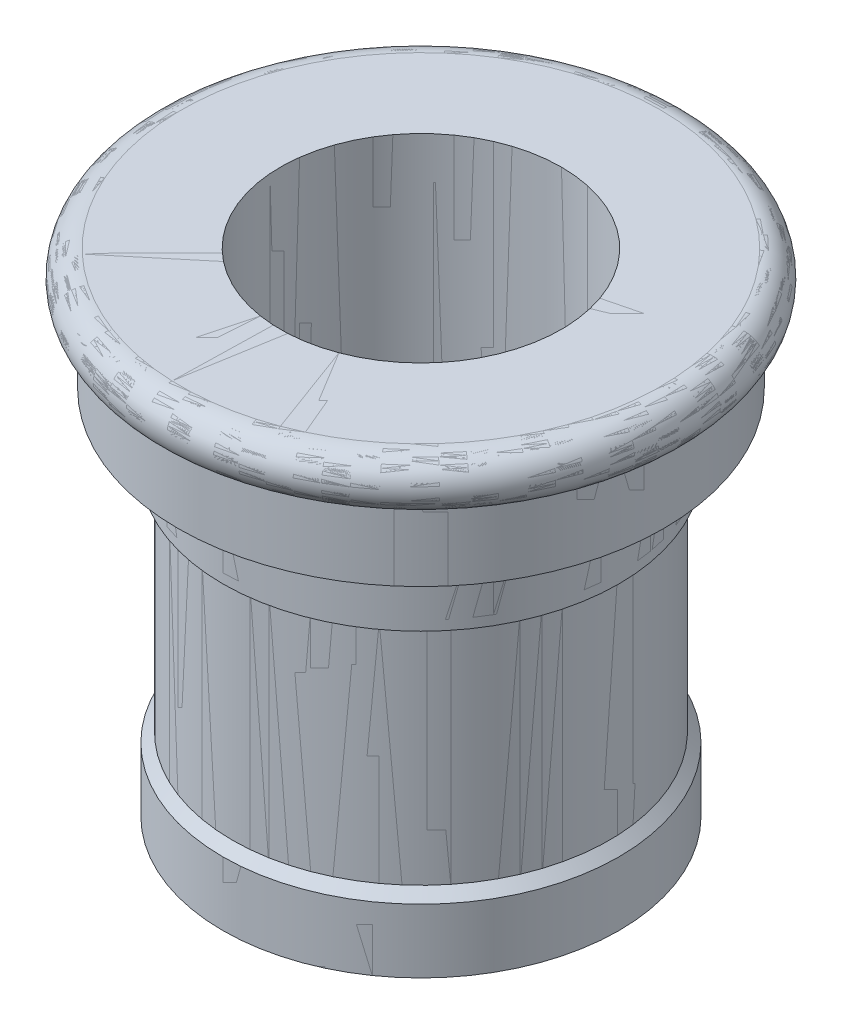
ISO-10303-21;
HEADER;
FILE_DESCRIPTION(('STEP AP214'),'2;1');
FILE_NAME('part.step','',(''),(''),'','','');
FILE_SCHEMA(('AUTOMOTIVE_DESIGN { 1 0 10303 214 1 1 1 1 }'));
ENDSEC;
DATA;
#1=APPLICATION_CONTEXT('core data for automotive mechanical design processes');
#2=APPLICATION_PROTOCOL_DEFINITION('international standard','automotive_design',2000,#1);
#3=PRODUCT_CONTEXT('',#1,'mechanical');
#4=PRODUCT('Part','Part','',(#3));
#5=PRODUCT_RELATED_PRODUCT_CATEGORY('part','',(#4));
#6=PRODUCT_DEFINITION_FORMATION('','',#4);
#7=PRODUCT_DEFINITION_CONTEXT('part definition',#1,'design');
#8=PRODUCT_DEFINITION('design','',#6,#7);
#9=PRODUCT_DEFINITION_SHAPE('','',#8);
#10=(LENGTH_UNIT() NAMED_UNIT(*) SI_UNIT(.MILLI.,.METRE.));
#11=(NAMED_UNIT(*) PLANE_ANGLE_UNIT() SI_UNIT($,.RADIAN.));
#12=(NAMED_UNIT(*) SI_UNIT($,.STERADIAN.) SOLID_ANGLE_UNIT());
#13=UNCERTAINTY_MEASURE_WITH_UNIT(LENGTH_MEASURE(1.E-05),#10,'distance_accuracy_value','');
#14=(GEOMETRIC_REPRESENTATION_CONTEXT(3) GLOBAL_UNCERTAINTY_ASSIGNED_CONTEXT((#13)) GLOBAL_UNIT_ASSIGNED_CONTEXT((#10,
#11,#12)) REPRESENTATION_CONTEXT('',''));
#15=CARTESIAN_POINT('',(0.,0.,0.));
#16=DIRECTION('',(0.,0.,1.));
#17=DIRECTION('',(1.,0.,0.));
#18=AXIS2_PLACEMENT_3D('',#15,#16,#17);
#19=CARTESIAN_POINT('',(0.,73.,0.));
#20=DIRECTION('',(0.,-1.,0.));
#21=DIRECTION('',(0.,0.,-1.));
#22=AXIS2_PLACEMENT_3D('',#19,#20,#21);
#23=TOROIDAL_SURFACE('',#22,37.5,4.);
#24=CARTESIAN_POINT('',(0.,69.,0.));
#25=DIRECTION('',(0.,-1.,0.));
#26=DIRECTION('',(0.,0.,-1.));
#27=AXIS2_PLACEMENT_3D('',#24,#25,#26);
#28=CIRCLE('',#27,37.5);
#29=CARTESIAN_POINT('',(0.,69.,-37.5));
#30=VERTEX_POINT('',#29);
#31=EDGE_CURVE('E50',#30,#30,#28,.T.);
#32=ORIENTED_EDGE('',*,*,#31,.F.);
#33=EDGE_LOOP('',(#32));
#34=FACE_BOUND('',#33,.T.);
#35=CARTESIAN_POINT('',(0.,77.,0.));
#36=DIRECTION('',(0.,-1.,0.));
#37=DIRECTION('',(0.,0.,-1.));
#38=AXIS2_PLACEMENT_3D('',#35,#36,#37);
#39=CIRCLE('',#38,37.5);
#40=CARTESIAN_POINT('',(0.,77.,-37.5));
#41=VERTEX_POINT('',#40);
#42=EDGE_CURVE('E80',#41,#41,#39,.T.);
#43=ORIENTED_EDGE('',*,*,#42,.T.);
#44=EDGE_LOOP('',(#43));
#45=FACE_BOUND('',#44,.T.);
#46=ADVANCED_FACE('F39',(#34,#45),#23,.T.);
#47=CARTESIAN_POINT('',(-38.,69.,0.));
#48=DIRECTION('',(0.,-1.,0.));
#49=DIRECTION('',(0.,0.,-1.));
#50=AXIS2_PLACEMENT_3D('',#47,#48,#49);
#51=PLANE('',#50);
#52=CARTESIAN_POINT('',(0.,69.,0.));
#53=DIRECTION('',(0.,-1.,0.));
#54=DIRECTION('',(0.,0.,-1.));
#55=AXIS2_PLACEMENT_3D('',#52,#53,#54);
#56=CIRCLE('',#55,38.);
#57=CARTESIAN_POINT('',(0.,69.,-38.));
#58=VERTEX_POINT('',#57);
#59=EDGE_CURVE('E54',#58,#58,#56,.T.);
#60=ORIENTED_EDGE('',*,*,#59,.F.);
#61=EDGE_LOOP('',(#60));
#62=FACE_BOUND('',#61,.T.);
#63=ORIENTED_EDGE('',*,*,#31,.T.);
#64=EDGE_LOOP('',(#63));
#65=FACE_BOUND('',#64,.T.);
#66=ADVANCED_FACE('F118',(#62,#65),#51,.F.);
#67=CARTESIAN_POINT('',(0.,0.,0.));
#68=DIRECTION('',(0.,-1.,0.));
#69=DIRECTION('',(0.,0.,-1.));
#70=AXIS2_PLACEMENT_3D('',#67,#68,#69);
#71=CYLINDRICAL_SURFACE('',#70,38.);
#72=CARTESIAN_POINT('',(0.,58.,0.));
#73=DIRECTION('',(0.,-1.,0.));
#74=DIRECTION('',(0.,0.,-1.));
#75=AXIS2_PLACEMENT_3D('',#72,#73,#74);
#76=CIRCLE('',#75,38.);
#77=CARTESIAN_POINT('',(0.,58.,-38.));
#78=VERTEX_POINT('',#77);
#79=EDGE_CURVE('E59',#78,#78,#76,.T.);
#80=ORIENTED_EDGE('',*,*,#79,.F.);
#81=EDGE_LOOP('',(#80));
#82=FACE_BOUND('',#81,.T.);
#83=ORIENTED_EDGE('',*,*,#59,.T.);
#84=EDGE_LOOP('',(#83));
#85=FACE_BOUND('',#84,.T.);
#86=ADVANCED_FACE('F124',(#82,#85),#71,.T.);
#87=CARTESIAN_POINT('',(-31.,58.,0.));
#88=DIRECTION('',(0.,1.,0.));
#89=DIRECTION('',(0.,0.,1.));
#90=AXIS2_PLACEMENT_3D('',#87,#88,#89);
#91=PLANE('',#90);
#92=CARTESIAN_POINT('',(0.,58.,0.));
#93=DIRECTION('',(0.,-1.,0.));
#94=DIRECTION('',(0.,0.,-1.));
#95=AXIS2_PLACEMENT_3D('',#92,#93,#94);
#96=CIRCLE('',#95,31.);
#97=CARTESIAN_POINT('',(0.,58.,-31.));
#98=VERTEX_POINT('',#97);
#99=EDGE_CURVE('E62',#98,#98,#96,.T.);
#100=ORIENTED_EDGE('',*,*,#99,.F.);
#101=EDGE_LOOP('',(#100));
#102=FACE_BOUND('',#101,.T.);
#103=ORIENTED_EDGE('',*,*,#79,.T.);
#104=EDGE_LOOP('',(#103));
#105=FACE_BOUND('',#104,.T.);
#106=ADVANCED_FACE('F131',(#102,#105),#91,.F.);
#107=CARTESIAN_POINT('',(0.,0.,0.));
#108=DIRECTION('',(0.,-1.,0.));
#109=DIRECTION('',(0.,0.,-1.));
#110=AXIS2_PLACEMENT_3D('',#107,#108,#109);
#111=CYLINDRICAL_SURFACE('',#110,31.);
#112=CARTESIAN_POINT('',(0.,48.5,0.));
#113=DIRECTION('',(0.,1.,0.));
#114=DIRECTION('',(0.,0.,1.));
#115=AXIS2_PLACEMENT_3D('',#112,#113,#114);
#116=CIRCLE('',#115,31.);
#117=CARTESIAN_POINT('',(0.,48.5,31.));
#118=VERTEX_POINT('',#117);
#119=EDGE_CURVE('E46',#118,#118,#116,.T.);
#120=ORIENTED_EDGE('',*,*,#119,.T.);
#121=EDGE_LOOP('',(#120));
#122=FACE_BOUND('',#121,.T.);
#123=ORIENTED_EDGE('',*,*,#99,.T.);
#124=EDGE_LOOP('',(#123));
#125=FACE_BOUND('',#124,.T.);
#126=ADVANCED_FACE('F135',(#122,#125),#111,.T.);
#127=CARTESIAN_POINT('',(0.,0.,0.));
#128=DIRECTION('',(0.,-1.,0.));
#129=DIRECTION('',(0.,0.,-1.));
#130=AXIS2_PLACEMENT_3D('',#127,#128,#129);
#131=CYLINDRICAL_SURFACE('',#130,29.5);
#132=CARTESIAN_POINT('',(0.,11.5,0.));
#133=DIRECTION('',(0.,-1.,0.));
#134=DIRECTION('',(0.,0.,-1.));
#135=AXIS2_PLACEMENT_3D('',#132,#133,#134);
#136=CIRCLE('',#135,29.5);
#137=CARTESIAN_POINT('',(0.,11.5,-29.5));
#138=VERTEX_POINT('',#137);
#139=EDGE_CURVE('E11',#138,#138,#136,.F.);
#140=ORIENTED_EDGE('',*,*,#139,.T.);
#141=EDGE_LOOP('',(#140));
#142=FACE_BOUND('',#141,.T.);
#143=CARTESIAN_POINT('',(0.,47.,0.));
#144=DIRECTION('',(0.,-1.,0.));
#145=DIRECTION('',(0.,0.,-1.));
#146=AXIS2_PLACEMENT_3D('',#143,#144,#145);
#147=CIRCLE('',#146,29.5);
#148=CARTESIAN_POINT('',(0.,47.,29.5));
#149=VERTEX_POINT('',#148);
#150=EDGE_CURVE('E65',#149,#149,#147,.T.);
#151=ORIENTED_EDGE('',*,*,#150,.T.);
#152=EDGE_LOOP('',(#151));
#153=FACE_BOUND('',#152,.T.);
#154=ADVANCED_FACE('F107',(#142,#153),#131,.T.);
#155=CARTESIAN_POINT('',(0.,0.,0.));
#156=DIRECTION('',(0.,-1.,0.));
#157=DIRECTION('',(0.,0.,-1.));
#158=AXIS2_PLACEMENT_3D('',#155,#156,#157);
#159=CYLINDRICAL_SURFACE('',#158,31.);
#160=CARTESIAN_POINT('',(0.,0.,0.));
#161=DIRECTION('',(0.,-1.,0.));
#162=DIRECTION('',(0.,0.,-1.));
#163=AXIS2_PLACEMENT_3D('',#160,#161,#162);
#164=CIRCLE('',#163,31.);
#165=CARTESIAN_POINT('',(0.,0.,-31.));
#166=VERTEX_POINT('',#165);
#167=EDGE_CURVE('E71',#166,#166,#164,.T.);
#168=ORIENTED_EDGE('',*,*,#167,.F.);
#169=EDGE_LOOP('',(#168));
#170=FACE_BOUND('',#169,.T.);
#171=CARTESIAN_POINT('',(0.,9.99999999999999,0.));
#172=DIRECTION('',(0.,-1.,0.));
#173=DIRECTION('',(0.,0.,-1.));
#174=AXIS2_PLACEMENT_3D('',#171,#172,#173);
#175=CIRCLE('',#174,31.);
#176=CARTESIAN_POINT('',(0.,9.99999999999999,-31.));
#177=VERTEX_POINT('',#176);
#178=EDGE_CURVE('E68',#177,#177,#175,.T.);
#179=ORIENTED_EDGE('',*,*,#178,.T.);
#180=EDGE_LOOP('',(#179));
#181=FACE_BOUND('',#180,.T.);
#182=ADVANCED_FACE('F101',(#170,#181),#159,.T.);
#183=CARTESIAN_POINT('',(-22.,0.,0.));
#184=DIRECTION('',(0.,1.,0.));
#185=DIRECTION('',(0.,0.,1.));
#186=AXIS2_PLACEMENT_3D('',#183,#184,#185);
#187=PLANE('',#186);
#188=CARTESIAN_POINT('',(0.,0.,0.));
#189=DIRECTION('',(0.,-1.,0.));
#190=DIRECTION('',(0.,0.,-1.));
#191=AXIS2_PLACEMENT_3D('',#188,#189,#190);
#192=CIRCLE('',#191,22.);
#193=CARTESIAN_POINT('',(0.,0.,-22.));
#194=VERTEX_POINT('',#193);
#195=EDGE_CURVE('E74',#194,#194,#192,.T.);
#196=ORIENTED_EDGE('',*,*,#195,.F.);
#197=EDGE_LOOP('',(#196));
#198=FACE_BOUND('',#197,.T.);
#199=ORIENTED_EDGE('',*,*,#167,.T.);
#200=EDGE_LOOP('',(#199));
#201=FACE_BOUND('',#200,.T.);
#202=ADVANCED_FACE('F95',(#198,#201),#187,.F.);
#203=CARTESIAN_POINT('',(0.,0.,0.));
#204=DIRECTION('',(0.,-1.,0.));
#205=DIRECTION('',(0.,0.,-1.));
#206=AXIS2_PLACEMENT_3D('',#203,#204,#205);
#207=CYLINDRICAL_SURFACE('',#206,22.);
#208=CARTESIAN_POINT('',(0.,77.,0.));
#209=DIRECTION('',(0.,-1.,0.));
#210=DIRECTION('',(0.,0.,-1.));
#211=AXIS2_PLACEMENT_3D('',#208,#209,#210);
#212=CIRCLE('',#211,22.);
#213=CARTESIAN_POINT('',(0.,77.,-22.));
#214=VERTEX_POINT('',#213);
#215=EDGE_CURVE('E77',#214,#214,#212,.T.);
#216=ORIENTED_EDGE('',*,*,#215,.F.);
#217=EDGE_LOOP('',(#216));
#218=FACE_BOUND('',#217,.T.);
#219=ORIENTED_EDGE('',*,*,#195,.T.);
#220=EDGE_LOOP('',(#219));
#221=FACE_BOUND('',#220,.T.);
#222=ADVANCED_FACE('F89',(#218,#221),#207,.F.);
#223=CARTESIAN_POINT('',(-22.,77.,0.));
#224=DIRECTION('',(0.,-1.,0.));
#225=DIRECTION('',(0.,0.,-1.));
#226=AXIS2_PLACEMENT_3D('',#223,#224,#225);
#227=PLANE('',#226);
#228=ORIENTED_EDGE('',*,*,#42,.F.);
#229=EDGE_LOOP('',(#228));
#230=FACE_BOUND('',#229,.T.);
#231=ORIENTED_EDGE('',*,*,#215,.T.);
#232=EDGE_LOOP('',(#231));
#233=FACE_BOUND('',#232,.T.);
#234=ADVANCED_FACE('F85',(#230,#233),#227,.F.);
#235=CARTESIAN_POINT('',(0.,47.,0.));
#236=DIRECTION('',(0.,1.,0.));
#237=DIRECTION('',(0.,0.,1.));
#238=AXIS2_PLACEMENT_3D('',#235,#236,#237);
#239=CONICAL_SURFACE('',#238,29.5,0.785398163397448);
#240=CARTESIAN_POINT('',(0.,48.5,31.));
#241=CARTESIAN_POINT('',(0.,48.484375,30.984375));
#242=CARTESIAN_POINT('',(0.,48.46875,30.96875));
#243=CARTESIAN_POINT('',(0.,48.4375,30.9375));
#244=CARTESIAN_POINT('',(0.,48.421875,30.921875));
#245=CARTESIAN_POINT('',(0.,48.390625,30.890625));
#246=CARTESIAN_POINT('',(0.,48.375,30.875));
#247=CARTESIAN_POINT('',(0.,48.34375,30.84375));
#248=CARTESIAN_POINT('',(0.,48.328125,30.828125));
#249=CARTESIAN_POINT('',(0.,48.296875,30.796875));
#250=CARTESIAN_POINT('',(0.,48.28125,30.78125));
#251=CARTESIAN_POINT('',(0.,48.25,30.75));
#252=CARTESIAN_POINT('',(0.,48.234375,30.734375));
#253=CARTESIAN_POINT('',(0.,48.203125,30.703125));
#254=CARTESIAN_POINT('',(0.,48.1875,30.6875));
#255=CARTESIAN_POINT('',(0.,48.15625,30.65625));
#256=CARTESIAN_POINT('',(0.,48.140625,30.640625));
#257=CARTESIAN_POINT('',(0.,48.109375,30.609375));
#258=CARTESIAN_POINT('',(0.,48.09375,30.59375));
#259=CARTESIAN_POINT('',(0.,48.0625,30.5625));
#260=CARTESIAN_POINT('',(0.,48.046875,30.546875));
#261=CARTESIAN_POINT('',(0.,48.015625,30.515625));
#262=CARTESIAN_POINT('',(0.,48.,30.5));
#263=CARTESIAN_POINT('',(0.,47.96875,30.46875));
#264=CARTESIAN_POINT('',(0.,47.953125,30.453125));
#265=CARTESIAN_POINT('',(0.,47.921875,30.421875));
#266=CARTESIAN_POINT('',(0.,47.90625,30.40625));
#267=CARTESIAN_POINT('',(0.,47.875,30.375));
#268=CARTESIAN_POINT('',(0.,47.859375,30.359375));
#269=CARTESIAN_POINT('',(0.,47.828125,30.328125));
#270=CARTESIAN_POINT('',(0.,47.8125,30.3125));
#271=CARTESIAN_POINT('',(0.,47.78125,30.28125));
#272=CARTESIAN_POINT('',(0.,47.765625,30.265625));
#273=CARTESIAN_POINT('',(0.,47.734375,30.234375));
#274=CARTESIAN_POINT('',(0.,47.71875,30.21875));
#275=CARTESIAN_POINT('',(0.,47.6875,30.1875));
#276=CARTESIAN_POINT('',(0.,47.671875,30.171875));
#277=CARTESIAN_POINT('',(0.,47.640625,30.140625));
#278=CARTESIAN_POINT('',(0.,47.625,30.125));
#279=CARTESIAN_POINT('',(0.,47.59375,30.09375));
#280=CARTESIAN_POINT('',(0.,47.578125,30.078125));
#281=CARTESIAN_POINT('',(0.,47.546875,30.046875));
#282=CARTESIAN_POINT('',(0.,47.53125,30.03125));
#283=CARTESIAN_POINT('',(0.,47.5,30.));
#284=CARTESIAN_POINT('',(0.,47.484375,29.984375));
#285=CARTESIAN_POINT('',(0.,47.453125,29.953125));
#286=CARTESIAN_POINT('',(0.,47.4375,29.9375));
#287=CARTESIAN_POINT('',(0.,47.40625,29.90625));
#288=CARTESIAN_POINT('',(0.,47.390625,29.890625));
#289=CARTESIAN_POINT('',(0.,47.359375,29.859375));
#290=CARTESIAN_POINT('',(0.,47.34375,29.84375));
#291=CARTESIAN_POINT('',(0.,47.3125,29.8125));
#292=CARTESIAN_POINT('',(0.,47.296875,29.796875));
#293=CARTESIAN_POINT('',(0.,47.265625,29.765625));
#294=CARTESIAN_POINT('',(0.,47.25,29.75));
#295=CARTESIAN_POINT('',(0.,47.21875,29.71875));
#296=CARTESIAN_POINT('',(0.,47.203125,29.703125));
#297=CARTESIAN_POINT('',(0.,47.171875,29.671875));
#298=CARTESIAN_POINT('',(0.,47.15625,29.65625));
#299=CARTESIAN_POINT('',(0.,47.125,29.625));
#300=CARTESIAN_POINT('',(0.,47.109375,29.609375));
#301=CARTESIAN_POINT('',(0.,47.078125,29.578125));
#302=CARTESIAN_POINT('',(0.,47.0625,29.5625));
#303=CARTESIAN_POINT('',(0.,47.03125,29.53125));
#304=CARTESIAN_POINT('',(0.,47.015625,29.515625));
#305=CARTESIAN_POINT('',(0.,47.,29.5));
#306=B_SPLINE_CURVE_WITH_KNOTS('',3,(#240,#241,#242,#243,#244,#245,#246,#247,#248,#249,#250,
#251,#252,#253,#254,#255,#256,#257,#258,#259,#260,#261,#262,#263,#264,#265,#266,#267,#268,#269,
#270,#271,#272,#273,#274,#275,#276,#277,#278,#279,#280,#281,#282,#283,#284,#285,#286,#287,#288,
#289,#290,#291,#292,#293,#294,#295,#296,#297,#298,#299,#300,#301,#302,#303,#304,#305),
.UNSPECIFIED.,.F.,.F.,(4,2,2,2,2,2,2,2,2,2,2,2,2,2,2,2,2,2,2,2,2,2,2,2,2,2,2,2,2,2,2,2,4),(0.,
0.0662912607362389,0.13258252147248,0.198873782208714,0.265165042944953,0.331456303681192,
0.397747564417428,0.464038825153667,0.530330085889906,0.596621346626143,0.662912607362382,
0.729203868098621,0.795495128834857,0.861786389571096,0.928077650307335,0.994368911043571,
1.06066017177981,1.12695143251605,1.19324269325229,1.25953395398852,1.32582521472476,
1.392116475461,1.45840773619724,1.52469899693348,1.59099025766971,1.65728151840595,
1.72357277914219,1.78986403987843,1.85615530061467,1.92244656135091,1.98873782208714,
2.05502908282338,2.12132034355962),.UNSPECIFIED.);
#307=EDGE_CURVE('BSEAM88',#118,#149,#306,.T.);
#308=ORIENTED_EDGE('',*,*,#119,.F.);
#309=ORIENTED_EDGE('',*,*,#150,.F.);
#310=ORIENTED_EDGE('',*,*,#307,.T.);
#311=ORIENTED_EDGE('',*,*,#307,.F.);
#312=EDGE_LOOP('',(#308,#310,#309,#311));
#313=FACE_BOUND('',#312,.T.);
#314=ADVANCED_FACE('F88',(#313),#239,.T.);
#315=CARTESIAN_POINT('',(0.,9.99999999999999,0.));
#316=DIRECTION('',(0.,-1.,0.));
#317=DIRECTION('',(0.,0.,-1.));
#318=AXIS2_PLACEMENT_3D('',#315,#316,#317);
#319=CONICAL_SURFACE('',#318,31.,0.785398163397454);
#320=CARTESIAN_POINT('',(0.,11.5,-29.5));
#321=CARTESIAN_POINT('',(0.,11.484375,-29.515625));
#322=CARTESIAN_POINT('',(0.,11.46875,-29.53125));
#323=CARTESIAN_POINT('',(0.,11.4375,-29.5625));
#324=CARTESIAN_POINT('',(0.,11.421875,-29.578125));
#325=CARTESIAN_POINT('',(0.,11.390625,-29.609375));
#326=CARTESIAN_POINT('',(0.,11.375,-29.625));
#327=CARTESIAN_POINT('',(0.,11.34375,-29.65625));
#328=CARTESIAN_POINT('',(0.,11.328125,-29.671875));
#329=CARTESIAN_POINT('',(0.,11.296875,-29.703125));
#330=CARTESIAN_POINT('',(0.,11.28125,-29.71875));
#331=CARTESIAN_POINT('',(0.,11.25,-29.75));
#332=CARTESIAN_POINT('',(0.,11.234375,-29.765625));
#333=CARTESIAN_POINT('',(0.,11.203125,-29.796875));
#334=CARTESIAN_POINT('',(0.,11.1875,-29.8125));
#335=CARTESIAN_POINT('',(0.,11.15625,-29.84375));
#336=CARTESIAN_POINT('',(0.,11.140625,-29.859375));
#337=CARTESIAN_POINT('',(0.,11.109375,-29.890625));
#338=CARTESIAN_POINT('',(0.,11.09375,-29.90625));
#339=CARTESIAN_POINT('',(0.,11.0625,-29.9375));
#340=CARTESIAN_POINT('',(0.,11.046875,-29.953125));
#341=CARTESIAN_POINT('',(0.,11.015625,-29.984375));
#342=CARTESIAN_POINT('',(0.,11.,-30.));
#343=CARTESIAN_POINT('',(0.,10.96875,-30.03125));
#344=CARTESIAN_POINT('',(0.,10.953125,-30.046875));
#345=CARTESIAN_POINT('',(0.,10.921875,-30.078125));
#346=CARTESIAN_POINT('',(0.,10.90625,-30.09375));
#347=CARTESIAN_POINT('',(0.,10.875,-30.125));
#348=CARTESIAN_POINT('',(0.,10.859375,-30.140625));
#349=CARTESIAN_POINT('',(0.,10.828125,-30.171875));
#350=CARTESIAN_POINT('',(0.,10.8125,-30.1875));
#351=CARTESIAN_POINT('',(0.,10.78125,-30.21875));
#352=CARTESIAN_POINT('',(0.,10.765625,-30.234375));
#353=CARTESIAN_POINT('',(0.,10.734375,-30.265625));
#354=CARTESIAN_POINT('',(0.,10.71875,-30.28125));
#355=CARTESIAN_POINT('',(0.,10.6875,-30.3125));
#356=CARTESIAN_POINT('',(0.,10.671875,-30.328125));
#357=CARTESIAN_POINT('',(0.,10.640625,-30.359375));
#358=CARTESIAN_POINT('',(0.,10.625,-30.375));
#359=CARTESIAN_POINT('',(0.,10.59375,-30.40625));
#360=CARTESIAN_POINT('',(0.,10.578125,-30.421875));
#361=CARTESIAN_POINT('',(0.,10.546875,-30.453125));
#362=CARTESIAN_POINT('',(0.,10.53125,-30.46875));
#363=CARTESIAN_POINT('',(0.,10.5,-30.5));
#364=CARTESIAN_POINT('',(0.,10.484375,-30.515625));
#365=CARTESIAN_POINT('',(0.,10.453125,-30.546875));
#366=CARTESIAN_POINT('',(0.,10.4375,-30.5625));
#367=CARTESIAN_POINT('',(0.,10.40625,-30.59375));
#368=CARTESIAN_POINT('',(0.,10.390625,-30.609375));
#369=CARTESIAN_POINT('',(0.,10.359375,-30.640625));
#370=CARTESIAN_POINT('',(0.,10.34375,-30.65625));
#371=CARTESIAN_POINT('',(0.,10.3125,-30.6875));
#372=CARTESIAN_POINT('',(0.,10.296875,-30.703125));
#373=CARTESIAN_POINT('',(0.,10.265625,-30.734375));
#374=CARTESIAN_POINT('',(0.,10.25,-30.75));
#375=CARTESIAN_POINT('',(0.,10.21875,-30.78125));
#376=CARTESIAN_POINT('',(0.,10.203125,-30.796875));
#377=CARTESIAN_POINT('',(0.,10.171875,-30.828125));
#378=CARTESIAN_POINT('',(0.,10.15625,-30.84375));
#379=CARTESIAN_POINT('',(0.,10.125,-30.875));
#380=CARTESIAN_POINT('',(0.,10.109375,-30.890625));
#381=CARTESIAN_POINT('',(0.,10.078125,-30.921875));
#382=CARTESIAN_POINT('',(0.,10.0625,-30.9375));
#383=CARTESIAN_POINT('',(0.,10.03125,-30.96875));
#384=CARTESIAN_POINT('',(0.,10.015625,-30.984375));
#385=CARTESIAN_POINT('',(0.,9.99999999999999,-31.));
#386=B_SPLINE_CURVE_WITH_KNOTS('',3,(#320,#321,#322,#323,#324,#325,#326,#327,#328,#329,#330,
#331,#332,#333,#334,#335,#336,#337,#338,#339,#340,#341,#342,#343,#344,#345,#346,#347,#348,#349,
#350,#351,#352,#353,#354,#355,#356,#357,#358,#359,#360,#361,#362,#363,#364,#365,#366,#367,#368,
#369,#370,#371,#372,#373,#374,#375,#376,#377,#378,#379,#380,#381,#382,#383,#384,#385),
.UNSPECIFIED.,.F.,.F.,(4,2,2,2,2,2,2,2,2,2,2,2,2,2,2,2,2,2,2,2,2,2,2,2,2,2,2,2,2,2,2,2,4),(0.,
0.0662912607362389,0.132582521472479,0.198873782208719,0.265165042944959,0.331456303681198,
0.397747564417438,0.464038825153678,0.530330085889918,0.596621346626159,0.662912607362398,
0.729203868098638,0.795495128834878,0.861786389571118,0.928077650307356,0.994368911043597,
1.06066017177984,1.12695143251608,1.19324269325231,1.25953395398856,1.3258252147248,
1.39211647546104,1.45840773619728,1.52469899693352,1.59099025766976,1.657281518406,
1.72357277914224,1.78986403987847,1.85615530061471,1.92244656135096,1.9887378220872,
2.05502908282343,2.12132034355967),.UNSPECIFIED.);
#387=EDGE_CURVE('BSEAM41',#138,#177,#386,.T.);
#388=ORIENTED_EDGE('',*,*,#139,.F.);
#389=ORIENTED_EDGE('',*,*,#178,.F.);
#390=ORIENTED_EDGE('',*,*,#387,.T.);
#391=ORIENTED_EDGE('',*,*,#387,.F.);
#392=EDGE_LOOP('',(#388,#390,#389,#391));
#393=FACE_BOUND('',#392,.T.);
#394=ADVANCED_FACE('F41',(#393),#319,.T.);
#395=CLOSED_SHELL('',(#46,#66,#86,#106,#126,#154,#182,#202,#222,#234,#314,#394));
#396=MANIFOLD_SOLID_BREP('B2',#395);
#397=CARTESIAN_POINT('',(22.,77.,0.));
#398=DIRECTION('',(0.,1.,0.));
#399=DIRECTION('',(0.,0.,1.));
#400=AXIS2_PLACEMENT_3D('',#397,#398,#399);
#401=PLANE('',#400);
#402=CARTESIAN_POINT('',(0.,77.,0.));
#403=DIRECTION('',(0.,-1.,0.));
#404=DIRECTION('',(0.,0.,-1.));
#405=AXIS2_PLACEMENT_3D('',#402,#403,#404);
#406=CIRCLE('',#405,22.);
#407=CARTESIAN_POINT('',(0.,77.,-22.));
#408=VERTEX_POINT('',#407);
#409=EDGE_CURVE('E261',#408,#408,#406,.T.);
#410=ORIENTED_EDGE('',*,*,#409,.T.);
#411=EDGE_LOOP('',(#410));
#412=FACE_BOUND('',#411,.T.);
#413=CARTESIAN_POINT('',(0.,77.,0.));
#414=DIRECTION('',(0.,-1.,0.));
#415=DIRECTION('',(0.,0.,-1.));
#416=AXIS2_PLACEMENT_3D('',#413,#414,#415);
#417=CIRCLE('',#416,37.5);
#418=CARTESIAN_POINT('',(0.,77.,-37.5));
#419=VERTEX_POINT('',#418);
#420=EDGE_CURVE('E38',#419,#419,#417,.T.);
#421=ORIENTED_EDGE('',*,*,#420,.F.);
#422=EDGE_LOOP('',(#421));
#423=FACE_BOUND('',#422,.T.);
#424=ADVANCED_FACE('F221',(#412,#423),#401,.T.);
#425=CARTESIAN_POINT('',(0.,73.,0.));
#426=DIRECTION('',(0.,-1.,0.));
#427=DIRECTION('',(0.,0.,-1.));
#428=AXIS2_PLACEMENT_3D('',#425,#426,#427);
#429=TOROIDAL_SURFACE('',#428,37.5,4.);
#430=ORIENTED_EDGE('',*,*,#420,.T.);
#431=EDGE_LOOP('',(#430));
#432=FACE_BOUND('',#431,.T.);
#433=CARTESIAN_POINT('',(0.,69.,0.));
#434=DIRECTION('',(0.,-1.,0.));
#435=DIRECTION('',(0.,0.,-1.));
#436=AXIS2_PLACEMENT_3D('',#433,#434,#435);
#437=CIRCLE('',#436,37.5);
#438=CARTESIAN_POINT('',(0.,69.,-37.5));
#439=VERTEX_POINT('',#438);
#440=EDGE_CURVE('E227',#439,#439,#437,.T.);
#441=ORIENTED_EDGE('',*,*,#440,.F.);
#442=EDGE_LOOP('',(#441));
#443=FACE_BOUND('',#442,.T.);
#444=ADVANCED_FACE('F279',(#432,#443),#429,.T.);
#445=CARTESIAN_POINT('',(38.,69.,0.));
#446=DIRECTION('',(0.,1.,0.));
#447=DIRECTION('',(0.,0.,1.));
#448=AXIS2_PLACEMENT_3D('',#445,#446,#447);
#449=PLANE('',#448);
#450=ORIENTED_EDGE('',*,*,#440,.T.);
#451=EDGE_LOOP('',(#450));
#452=FACE_BOUND('',#451,.T.);
#453=CARTESIAN_POINT('',(0.,69.,0.));
#454=DIRECTION('',(0.,-1.,0.));
#455=DIRECTION('',(0.,0.,-1.));
#456=AXIS2_PLACEMENT_3D('',#453,#454,#455);
#457=CIRCLE('',#456,38.);
#458=CARTESIAN_POINT('',(0.,69.,-38.));
#459=VERTEX_POINT('',#458);
#460=EDGE_CURVE('E231',#459,#459,#457,.T.);
#461=ORIENTED_EDGE('',*,*,#460,.F.);
#462=EDGE_LOOP('',(#461));
#463=FACE_BOUND('',#462,.T.);
#464=ADVANCED_FACE('F283',(#452,#463),#449,.T.);
#465=CARTESIAN_POINT('',(0.,0.,0.));
#466=DIRECTION('',(0.,-1.,0.));
#467=DIRECTION('',(0.,0.,-1.));
#468=AXIS2_PLACEMENT_3D('',#465,#466,#467);
#469=CYLINDRICAL_SURFACE('',#468,38.);
#470=ORIENTED_EDGE('',*,*,#460,.T.);
#471=EDGE_LOOP('',(#470));
#472=FACE_BOUND('',#471,.T.);
#473=CARTESIAN_POINT('',(0.,58.,0.));
#474=DIRECTION('',(0.,-1.,0.));
#475=DIRECTION('',(0.,0.,-1.));
#476=AXIS2_PLACEMENT_3D('',#473,#474,#475);
#477=CIRCLE('',#476,38.);
#478=CARTESIAN_POINT('',(0.,58.,-38.));
#479=VERTEX_POINT('',#478);
#480=EDGE_CURVE('E235',#479,#479,#477,.T.);
#481=ORIENTED_EDGE('',*,*,#480,.F.);
#482=EDGE_LOOP('',(#481));
#483=FACE_BOUND('',#482,.T.);
#484=ADVANCED_FACE('F287',(#472,#483),#469,.T.);
#485=CARTESIAN_POINT('',(31.,58.,0.));
#486=DIRECTION('',(0.,-1.,0.));
#487=DIRECTION('',(0.,0.,-1.));
#488=AXIS2_PLACEMENT_3D('',#485,#486,#487);
#489=PLANE('',#488);
#490=ORIENTED_EDGE('',*,*,#480,.T.);
#491=EDGE_LOOP('',(#490));
#492=FACE_BOUND('',#491,.T.);
#493=CARTESIAN_POINT('',(0.,58.,0.));
#494=DIRECTION('',(0.,-1.,0.));
#495=DIRECTION('',(0.,0.,-1.));
#496=AXIS2_PLACEMENT_3D('',#493,#494,#495);
#497=CIRCLE('',#496,31.);
#498=CARTESIAN_POINT('',(0.,58.,-31.));
#499=VERTEX_POINT('',#498);
#500=EDGE_CURVE('E240',#499,#499,#497,.T.);
#501=ORIENTED_EDGE('',*,*,#500,.F.);
#502=EDGE_LOOP('',(#501));
#503=FACE_BOUND('',#502,.T.);
#504=ADVANCED_FACE('F293',(#492,#503),#489,.T.);
#505=CARTESIAN_POINT('',(0.,0.,0.));
#506=DIRECTION('',(0.,-1.,0.));
#507=DIRECTION('',(0.,0.,-1.));
#508=AXIS2_PLACEMENT_3D('',#505,#506,#507);
#509=CYLINDRICAL_SURFACE('',#508,31.);
#510=ORIENTED_EDGE('',*,*,#500,.T.);
#511=EDGE_LOOP('',(#510));
#512=FACE_BOUND('',#511,.T.);
#513=CARTESIAN_POINT('',(0.,47.,0.));
#514=DIRECTION('',(0.,-1.,0.));
#515=DIRECTION('',(0.,0.,-1.));
#516=AXIS2_PLACEMENT_3D('',#513,#514,#515);
#517=CIRCLE('',#516,31.);
#518=CARTESIAN_POINT('',(0.,47.,-31.));
#519=VERTEX_POINT('',#518);
#520=EDGE_CURVE('E243',#519,#519,#517,.T.);
#521=ORIENTED_EDGE('',*,*,#520,.F.);
#522=EDGE_LOOP('',(#521));
#523=FACE_BOUND('',#522,.T.);
#524=ADVANCED_FACE('F297',(#512,#523),#509,.T.);
#525=CARTESIAN_POINT('',(29.5,47.,0.));
#526=DIRECTION('',(0.,-1.,0.));
#527=DIRECTION('',(0.,0.,-1.));
#528=AXIS2_PLACEMENT_3D('',#525,#526,#527);
#529=PLANE('',#528);
#530=ORIENTED_EDGE('',*,*,#520,.T.);
#531=EDGE_LOOP('',(#530));
#532=FACE_BOUND('',#531,.T.);
#533=CARTESIAN_POINT('',(0.,47.,0.));
#534=DIRECTION('',(0.,-1.,0.));
#535=DIRECTION('',(0.,0.,-1.));
#536=AXIS2_PLACEMENT_3D('',#533,#534,#535);
#537=CIRCLE('',#536,29.5);
#538=CARTESIAN_POINT('',(0.,47.,-29.5));
#539=VERTEX_POINT('',#538);
#540=EDGE_CURVE('E246',#539,#539,#537,.T.);
#541=ORIENTED_EDGE('',*,*,#540,.F.);
#542=EDGE_LOOP('',(#541));
#543=FACE_BOUND('',#542,.T.);
#544=ADVANCED_FACE('F301',(#532,#543),#529,.T.);
#545=CARTESIAN_POINT('',(0.,0.,0.));
#546=DIRECTION('',(0.,-1.,0.));
#547=DIRECTION('',(0.,0.,-1.));
#548=AXIS2_PLACEMENT_3D('',#545,#546,#547);
#549=CYLINDRICAL_SURFACE('',#548,29.5);
#550=ORIENTED_EDGE('',*,*,#540,.T.);
#551=EDGE_LOOP('',(#550));
#552=FACE_BOUND('',#551,.T.);
#553=CARTESIAN_POINT('',(0.,9.99999999999999,0.));
#554=DIRECTION('',(0.,-1.,0.));
#555=DIRECTION('',(0.,0.,-1.));
#556=AXIS2_PLACEMENT_3D('',#553,#554,#555);
#557=CIRCLE('',#556,29.5);
#558=CARTESIAN_POINT('',(0.,9.99999999999999,-29.5));
#559=VERTEX_POINT('',#558);
#560=EDGE_CURVE('E249',#559,#559,#557,.T.);
#561=ORIENTED_EDGE('',*,*,#560,.F.);
#562=EDGE_LOOP('',(#561));
#563=FACE_BOUND('',#562,.T.);
#564=ADVANCED_FACE('F305',(#552,#563),#549,.T.);
#565=CARTESIAN_POINT('',(31.,9.99999999999999,0.));
#566=DIRECTION('',(0.,1.,0.));
#567=DIRECTION('',(0.,0.,1.));
#568=AXIS2_PLACEMENT_3D('',#565,#566,#567);
#569=PLANE('',#568);
#570=ORIENTED_EDGE('',*,*,#560,.T.);
#571=EDGE_LOOP('',(#570));
#572=FACE_BOUND('',#571,.T.);
#573=CARTESIAN_POINT('',(0.,9.99999999999999,0.));
#574=DIRECTION('',(0.,-1.,0.));
#575=DIRECTION('',(0.,0.,-1.));
#576=AXIS2_PLACEMENT_3D('',#573,#574,#575);
#577=CIRCLE('',#576,31.);
#578=CARTESIAN_POINT('',(0.,9.99999999999999,-31.));
#579=VERTEX_POINT('',#578);
#580=EDGE_CURVE('E252',#579,#579,#577,.T.);
#581=ORIENTED_EDGE('',*,*,#580,.F.);
#582=EDGE_LOOP('',(#581));
#583=FACE_BOUND('',#582,.T.);
#584=ADVANCED_FACE('F309',(#572,#583),#569,.T.);
#585=CARTESIAN_POINT('',(0.,0.,0.));
#586=DIRECTION('',(0.,-1.,0.));
#587=DIRECTION('',(0.,0.,-1.));
#588=AXIS2_PLACEMENT_3D('',#585,#586,#587);
#589=CYLINDRICAL_SURFACE('',#588,31.);
#590=ORIENTED_EDGE('',*,*,#580,.T.);
#591=EDGE_LOOP('',(#590));
#592=FACE_BOUND('',#591,.T.);
#593=CARTESIAN_POINT('',(0.,0.,0.));
#594=DIRECTION('',(0.,-1.,0.));
#595=DIRECTION('',(0.,0.,-1.));
#596=AXIS2_PLACEMENT_3D('',#593,#594,#595);
#597=CIRCLE('',#596,31.);
#598=CARTESIAN_POINT('',(0.,0.,-31.));
#599=VERTEX_POINT('',#598);
#600=EDGE_CURVE('E255',#599,#599,#597,.T.);
#601=ORIENTED_EDGE('',*,*,#600,.F.);
#602=EDGE_LOOP('',(#601));
#603=FACE_BOUND('',#602,.T.);
#604=ADVANCED_FACE('F275',(#592,#603),#589,.T.);
#605=CARTESIAN_POINT('',(22.,0.,0.));
#606=DIRECTION('',(0.,-1.,0.));
#607=DIRECTION('',(0.,0.,-1.));
#608=AXIS2_PLACEMENT_3D('',#605,#606,#607);
#609=PLANE('',#608);
#610=ORIENTED_EDGE('',*,*,#600,.T.);
#611=EDGE_LOOP('',(#610));
#612=FACE_BOUND('',#611,.T.);
#613=CARTESIAN_POINT('',(0.,0.,0.));
#614=DIRECTION('',(0.,-1.,0.));
#615=DIRECTION('',(0.,0.,-1.));
#616=AXIS2_PLACEMENT_3D('',#613,#614,#615);
#617=CIRCLE('',#616,22.);
#618=CARTESIAN_POINT('',(0.,0.,-22.));
#619=VERTEX_POINT('',#618);
#620=EDGE_CURVE('E258',#619,#619,#617,.T.);
#621=ORIENTED_EDGE('',*,*,#620,.F.);
#622=EDGE_LOOP('',(#621));
#623=FACE_BOUND('',#622,.T.);
#624=ADVANCED_FACE('F269',(#612,#623),#609,.T.);
#625=CARTESIAN_POINT('',(0.,0.,0.));
#626=DIRECTION('',(0.,-1.,0.));
#627=DIRECTION('',(0.,0.,-1.));
#628=AXIS2_PLACEMENT_3D('',#625,#626,#627);
#629=CYLINDRICAL_SURFACE('',#628,22.);
#630=ORIENTED_EDGE('',*,*,#620,.T.);
#631=EDGE_LOOP('',(#630));
#632=FACE_BOUND('',#631,.T.);
#633=ORIENTED_EDGE('',*,*,#409,.F.);
#634=EDGE_LOOP('',(#633));
#635=FACE_BOUND('',#634,.T.);
#636=ADVANCED_FACE('F267',(#632,#635),#629,.F.);
#637=CLOSED_SHELL('',(#424,#444,#464,#484,#504,#524,#544,#564,#584,#604,#624,#636));
#638=MANIFOLD_SOLID_BREP('B6',#637);
#639=ADVANCED_BREP_SHAPE_REPRESENTATION('',(#18,#396,#638),#14);
#640=SHAPE_DEFINITION_REPRESENTATION(#9,#639);
ENDSEC;
END-ISO-10303-21;
